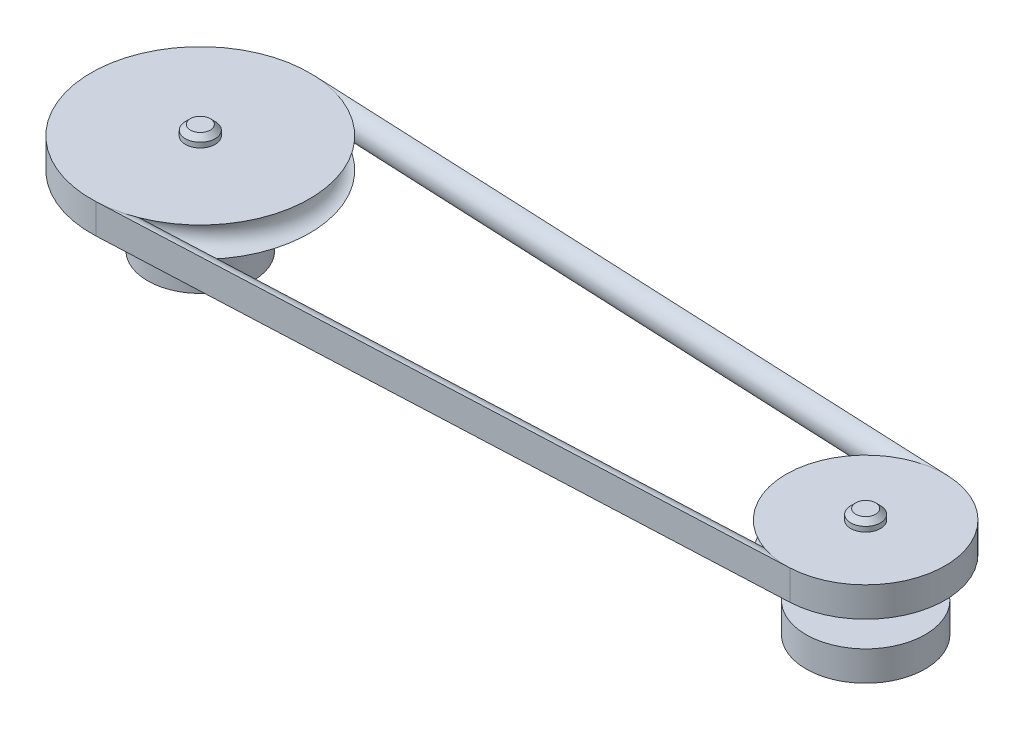
ISO-10303-21;
HEADER;
FILE_DESCRIPTION(('STEP AP214'),'2;1');
FILE_NAME('part.step','',(''),(''),'','','');
FILE_SCHEMA(('AUTOMOTIVE_DESIGN { 1 0 10303 214 1 1 1 1 }'));
ENDSEC;
DATA;
#1=APPLICATION_CONTEXT('core data for automotive mechanical design processes');
#2=APPLICATION_PROTOCOL_DEFINITION('international standard','automotive_design',2000,#1);
#3=PRODUCT_CONTEXT('',#1,'mechanical');
#4=PRODUCT('Part','Part','',(#3));
#5=PRODUCT_RELATED_PRODUCT_CATEGORY('part','',(#4));
#6=PRODUCT_DEFINITION_FORMATION('','',#4);
#7=PRODUCT_DEFINITION_CONTEXT('part definition',#1,'design');
#8=PRODUCT_DEFINITION('design','',#6,#7);
#9=PRODUCT_DEFINITION_SHAPE('','',#8);
#10=(LENGTH_UNIT() NAMED_UNIT(*) SI_UNIT(.MILLI.,.METRE.));
#11=(NAMED_UNIT(*) PLANE_ANGLE_UNIT() SI_UNIT($,.RADIAN.));
#12=(NAMED_UNIT(*) SI_UNIT($,.STERADIAN.) SOLID_ANGLE_UNIT());
#13=UNCERTAINTY_MEASURE_WITH_UNIT(LENGTH_MEASURE(1.E-05),#10,'distance_accuracy_value','');
#14=(GEOMETRIC_REPRESENTATION_CONTEXT(3) GLOBAL_UNCERTAINTY_ASSIGNED_CONTEXT((#13)) GLOBAL_UNIT_ASSIGNED_CONTEXT((#10,
#11,#12)) REPRESENTATION_CONTEXT('',''));
#15=CARTESIAN_POINT('',(0.,0.,0.));
#16=DIRECTION('',(0.,0.,1.));
#17=DIRECTION('',(1.,0.,0.));
#18=AXIS2_PLACEMENT_3D('',#15,#16,#17);
#19=CARTESIAN_POINT('',(-167.5,55.,0.));
#20=DIRECTION('',(0.,-1.,0.));
#21=DIRECTION('',(0.,0.,-1.));
#22=AXIS2_PLACEMENT_3D('',#19,#20,#21);
#23=CYLINDRICAL_SURFACE('',#22,7.50000000000001);
#24=CARTESIAN_POINT('',(-167.5,35.,0.));
#25=DIRECTION('',(0.,-1.,0.));
#26=DIRECTION('',(0.,0.,-1.));
#27=AXIS2_PLACEMENT_3D('',#24,#25,#26);
#28=CIRCLE('',#27,7.50000000000001);
#29=CARTESIAN_POINT('',(-167.5,35.,-7.50000000000001));
#30=VERTEX_POINT('',#29);
#31=EDGE_CURVE('E265',#30,#30,#28,.T.);
#32=ORIENTED_EDGE('',*,*,#31,.T.);
#33=EDGE_LOOP('',(#32));
#34=FACE_BOUND('',#33,.T.);
#35=CARTESIAN_POINT('',(-167.5,15.,0.));
#36=DIRECTION('',(0.,-1.,0.));
#37=DIRECTION('',(0.,0.,-1.));
#38=AXIS2_PLACEMENT_3D('',#35,#36,#37);
#39=CIRCLE('',#38,7.50000000000001);
#40=CARTESIAN_POINT('',(-167.5,15.,-7.50000000000001));
#41=VERTEX_POINT('',#40);
#42=EDGE_CURVE('E55',#41,#41,#39,.T.);
#43=ORIENTED_EDGE('',*,*,#42,.F.);
#44=EDGE_LOOP('',(#43));
#45=FACE_BOUND('',#44,.T.);
#46=ADVANCED_FACE('F46',(#34,#45),#23,.T.);
#47=CARTESIAN_POINT('',(-222.5,35.,0.));
#48=DIRECTION('',(0.,-1.,0.));
#49=DIRECTION('',(0.,0.,-1.));
#50=AXIS2_PLACEMENT_3D('',#47,#48,#49);
#51=PLANE('',#50);
#52=ORIENTED_EDGE('',*,*,#31,.F.);
#53=EDGE_LOOP('',(#52));
#54=FACE_BOUND('',#53,.T.);
#55=CARTESIAN_POINT('',(-167.5,35.,0.));
#56=DIRECTION('',(0.,-1.,0.));
#57=DIRECTION('',(0.,0.,-1.));
#58=AXIS2_PLACEMENT_3D('',#55,#56,#57);
#59=CIRCLE('',#58,55.);
#60=CARTESIAN_POINT('',(-165.037313432837,35.,54.9448375634319));
#61=VERTEX_POINT('',#60);
#62=CARTESIAN_POINT('',(-165.037313432835,35.,-54.9448375634318));
#63=VERTEX_POINT('',#62);
#64=EDGE_CURVE('E263',#61,#63,#59,.F.);
#65=ORIENTED_EDGE('',*,*,#64,.F.);
#66=CARTESIAN_POINT('',(-167.5,35.,0.));
#67=DIRECTION('',(0.,1.,0.));
#68=DIRECTION('',(0.,0.,1.));
#69=AXIS2_PLACEMENT_3D('',#66,#67,#68);
#70=CIRCLE('',#69,55.);
#71=EDGE_CURVE('E77',#63,#61,#70,.T.);
#72=ORIENTED_EDGE('',*,*,#71,.F.);
#73=EDGE_LOOP('',(#65,#72));
#74=FACE_BOUND('',#73,.T.);
#75=ADVANCED_FACE('F208',(#54,#74),#51,.T.);
#76=CARTESIAN_POINT('',(-167.5,42.5,0.));
#77=DIRECTION('',(0.,-1.,0.));
#78=DIRECTION('',(0.,0.,-1.));
#79=AXIS2_PLACEMENT_3D('',#76,#77,#78);
#80=TOROIDAL_SURFACE('',#79,55.,7.50000000000001);
#81=CARTESIAN_POINT('',(-165.037313432836,42.5,54.9448375634319));
#82=DIRECTION('',(0.998997046607851,0.,-0.0447761194029851));
#83=DIRECTION('',(0.,-1.,0.));
#84=AXIS2_PLACEMENT_3D('',#81,#82,#83);
#85=CIRCLE('',#84,7.50000000000001);
#86=CARTESIAN_POINT('',(-165.037313432836,50.,54.9448375634318));
#87=VERTEX_POINT('',#86);
#88=EDGE_CURVE('E116',#61,#87,#85,.T.);
#89=ORIENTED_EDGE('',*,*,#88,.F.);
#90=ORIENTED_EDGE('',*,*,#64,.T.);
#91=CARTESIAN_POINT('',(-165.037313432835,42.5,-54.9448375634318));
#92=DIRECTION('',(-0.998997046607851,0.,-0.0447761194029987));
#93=DIRECTION('',(0.0447761194029987,0.,-0.998997046607851));
#94=AXIS2_PLACEMENT_3D('',#91,#92,#93);
#95=CIRCLE('',#94,7.50000000000001);
#96=CARTESIAN_POINT('',(-165.037313432835,50.,-54.9448375634318));
#97=VERTEX_POINT('',#96);
#98=EDGE_CURVE('E240',#63,#97,#95,.T.);
#99=ORIENTED_EDGE('',*,*,#98,.T.);
#100=CARTESIAN_POINT('',(-167.5,50.,0.));
#101=DIRECTION('',(0.,-1.,0.));
#102=DIRECTION('',(0.,0.,-1.));
#103=AXIS2_PLACEMENT_3D('',#100,#101,#102);
#104=CIRCLE('',#103,55.);
#105=EDGE_CURVE('E176',#87,#97,#104,.F.);
#106=ORIENTED_EDGE('',*,*,#105,.F.);
#107=EDGE_LOOP('',(#89,#90,#99,#106));
#108=FACE_BOUND('',#107,.T.);
#109=ADVANCED_FACE('F157',(#108),#80,.F.);
#110=CARTESIAN_POINT('',(-167.5,55.,0.));
#111=DIRECTION('',(0.,1.,0.));
#112=DIRECTION('',(0.,0.,1.));
#113=AXIS2_PLACEMENT_3D('',#110,#111,#112);
#114=PLANE('',#113);
#115=CARTESIAN_POINT('',(-167.5,55.,0.));
#116=DIRECTION('',(0.,1.,0.));
#117=DIRECTION('',(0.,0.,1.));
#118=AXIS2_PLACEMENT_3D('',#115,#116,#117);
#119=CIRCLE('',#118,4.99999999999995);
#120=CARTESIAN_POINT('',(-167.5,55.,4.99999999999995));
#121=VERTEX_POINT('',#120);
#122=EDGE_CURVE('E238',#121,#121,#119,.T.);
#123=ORIENTED_EDGE('',*,*,#122,.T.);
#124=EDGE_LOOP('',(#123));
#125=FACE_BOUND('',#124,.T.);
#126=ADVANCED_FACE('F222',(#125),#114,.T.);
#127=CARTESIAN_POINT('',(-167.5,52.4999999999999,0.));
#128=DIRECTION('',(0.,1.,0.));
#129=DIRECTION('',(0.,0.,1.));
#130=AXIS2_PLACEMENT_3D('',#127,#128,#129);
#131=CIRCLE('',#130,7.50000000000001);
#132=CARTESIAN_POINT('',(-167.5,52.4999999999999,7.50000000000001));
#133=VERTEX_POINT('',#132);
#134=EDGE_CURVE('E233',#133,#133,#131,.F.);
#135=ORIENTED_EDGE('',*,*,#134,.T.);
#136=EDGE_LOOP('',(#135));
#137=FACE_BOUND('',#136,.T.);
#138=CARTESIAN_POINT('',(-167.5,50.,0.));
#139=DIRECTION('',(0.,1.,0.));
#140=DIRECTION('',(0.,0.,1.));
#141=AXIS2_PLACEMENT_3D('',#138,#139,#140);
#142=CIRCLE('',#141,7.50000000000001);
#143=CARTESIAN_POINT('',(-167.5,50.,7.50000000000001));
#144=VERTEX_POINT('',#143);
#145=EDGE_CURVE('E185',#144,#144,#142,.T.);
#146=ORIENTED_EDGE('',*,*,#145,.T.);
#147=EDGE_LOOP('',(#146));
#148=FACE_BOUND('',#147,.T.);
#149=ADVANCED_FACE('F211',(#137,#148),#23,.T.);
#150=CARTESIAN_POINT('',(-222.5,50.,0.));
#151=DIRECTION('',(0.,1.,0.));
#152=DIRECTION('',(0.,0.,1.));
#153=AXIS2_PLACEMENT_3D('',#150,#151,#152);
#154=PLANE('',#153);
#155=ORIENTED_EDGE('',*,*,#145,.F.);
#156=EDGE_LOOP('',(#155));
#157=FACE_BOUND('',#156,.T.);
#158=ORIENTED_EDGE('',*,*,#105,.T.);
#159=CARTESIAN_POINT('',(-167.5,50.,0.));
#160=DIRECTION('',(0.,1.,0.));
#161=DIRECTION('',(0.,0.,1.));
#162=AXIS2_PLACEMENT_3D('',#159,#160,#161);
#163=CIRCLE('',#162,55.);
#164=EDGE_CURVE('E121',#97,#87,#163,.T.);
#165=ORIENTED_EDGE('',*,*,#164,.T.);
#166=EDGE_LOOP('',(#158,#165));
#167=FACE_BOUND('',#166,.T.);
#168=ADVANCED_FACE('F156',(#157,#167),#154,.T.);
#169=CARTESIAN_POINT('',(169.291044776119,50.,39.9598818643141));
#170=DIRECTION('',(-0.0447761194029851,0.,-0.998997046607851));
#171=DIRECTION('',(-0.998997046607851,0.,0.0447761194029851));
#172=AXIS2_PLACEMENT_3D('',#169,#170,#171);
#173=PLANE('',#172);
#174=DIRECTION('',(0.,-1.,0.));
#175=VECTOR('',#174,1.);
#176=CARTESIAN_POINT('',(169.291044776119,50.,39.9598818643141));
#177=LINE('',#176,#175);
#178=CARTESIAN_POINT('',(169.291044776119,50.,39.9598818643141));
#179=VERTEX_POINT('',#178);
#180=CARTESIAN_POINT('',(169.291044776119,35.,39.9598818643141));
#181=VERTEX_POINT('',#180);
#182=EDGE_CURVE('E124',#179,#181,#177,.T.);
#183=ORIENTED_EDGE('',*,*,#182,.F.);
#184=DIRECTION('',(-0.998997046607851,0.,0.0447761194029851));
#185=VECTOR('',#184,1.);
#186=CARTESIAN_POINT('',(169.291044776119,50.,39.9598818643141));
#187=LINE('',#186,#185);
#188=EDGE_CURVE('E112',#179,#87,#187,.T.);
#189=ORIENTED_EDGE('',*,*,#188,.T.);
#190=CARTESIAN_POINT('',(-165.037313432837,50.,54.9448375634319));
#191=DIRECTION('',(0.,-1.,0.));
#192=VECTOR('',#191,1.);
#193=LINE('',#190,#192);
#194=EDGE_CURVE('E120',#87,#61,#193,.T.);
#195=ORIENTED_EDGE('',*,*,#194,.T.);
#196=DIRECTION('',(-0.998997046607851,0.,0.0447761194029851));
#197=VECTOR('',#196,1.);
#198=CARTESIAN_POINT('',(169.291044776119,35.,39.9598818643141));
#199=LINE('',#198,#197);
#200=EDGE_CURVE('E126',#181,#61,#199,.T.);
#201=ORIENTED_EDGE('',*,*,#200,.F.);
#202=EDGE_LOOP('',(#183,#189,#195,#201));
#203=FACE_BOUND('',#202,.T.);
#204=ADVANCED_FACE('F125',(#203),#173,.F.);
#205=CARTESIAN_POINT('',(169.291044776119,42.5,39.9598818643141));
#206=DIRECTION('',(-0.998997046607851,0.,0.0447761194029851));
#207=DIRECTION('',(0.0447761194029851,0.,0.998997046607851));
#208=AXIS2_PLACEMENT_3D('',#205,#206,#207);
#209=CYLINDRICAL_SURFACE('',#208,7.50000000000001);
#210=CARTESIAN_POINT('',(169.291044776119,42.5,39.9598818643141));
#211=DIRECTION('',(0.998997046607852,0.,-0.0447761194029716));
#212=DIRECTION('',(0.0447761194029716,0.,0.998997046607852));
#213=AXIS2_PLACEMENT_3D('',#210,#211,#212);
#214=CIRCLE('',#213,7.50000000000001);
#215=EDGE_CURVE('E94',#181,#179,#214,.T.);
#216=ORIENTED_EDGE('',*,*,#215,.F.);
#217=ORIENTED_EDGE('',*,*,#200,.T.);
#218=ORIENTED_EDGE('',*,*,#88,.T.);
#219=ORIENTED_EDGE('',*,*,#188,.F.);
#220=EDGE_LOOP('',(#216,#217,#218,#219));
#221=FACE_BOUND('',#220,.T.);
#222=ADVANCED_FACE('F114',(#221),#209,.T.);
#223=CARTESIAN_POINT('',(167.5,42.5,0.));
#224=DIRECTION('',(0.,-1.,0.));
#225=DIRECTION('',(0.,0.,-1.));
#226=AXIS2_PLACEMENT_3D('',#223,#224,#225);
#227=CYLINDRICAL_SURFACE('',#226,40.);
#228=DIRECTION('',(0.,-1.,0.));
#229=VECTOR('',#228,1.);
#230=CARTESIAN_POINT('',(169.29104477612,50.,-39.9598818643141));
#231=LINE('',#230,#229);
#232=CARTESIAN_POINT('',(169.29104477612,50.,-39.9598818643141));
#233=VERTEX_POINT('',#232);
#234=CARTESIAN_POINT('',(169.291044776119,35.,-39.9598818643141));
#235=VERTEX_POINT('',#234);
#236=EDGE_CURVE('E132',#233,#235,#231,.T.);
#237=ORIENTED_EDGE('',*,*,#236,.F.);
#238=CARTESIAN_POINT('',(167.5,50.,0.));
#239=DIRECTION('',(0.,-1.,0.));
#240=DIRECTION('',(0.,0.,-1.));
#241=AXIS2_PLACEMENT_3D('',#238,#239,#240);
#242=CIRCLE('',#241,40.);
#243=EDGE_CURVE('E62',#233,#179,#242,.T.);
#244=ORIENTED_EDGE('',*,*,#243,.T.);
#245=ORIENTED_EDGE('',*,*,#182,.T.);
#246=CARTESIAN_POINT('',(167.5,35.,0.));
#247=DIRECTION('',(0.,-1.,0.));
#248=DIRECTION('',(0.,0.,-1.));
#249=AXIS2_PLACEMENT_3D('',#246,#247,#248);
#250=CIRCLE('',#249,40.);
#251=EDGE_CURVE('E135',#235,#181,#250,.T.);
#252=ORIENTED_EDGE('',*,*,#251,.F.);
#253=EDGE_LOOP('',(#237,#244,#245,#252));
#254=FACE_BOUND('',#253,.T.);
#255=ADVANCED_FACE('F130',(#254),#227,.T.);
#256=CARTESIAN_POINT('',(-165.037313432835,50.,-54.9448375634318));
#257=DIRECTION('',(-0.044776119402985,0.,0.998997046607851));
#258=DIRECTION('',(0.998997046607851,0.,0.044776119402985));
#259=AXIS2_PLACEMENT_3D('',#256,#257,#258);
#260=PLANE('',#259);
#261=DIRECTION('',(0.,-1.,0.));
#262=VECTOR('',#261,1.);
#263=CARTESIAN_POINT('',(-165.037313432835,50.,-54.9448375634318));
#264=LINE('',#263,#262);
#265=EDGE_CURVE('E172',#97,#63,#264,.T.);
#266=ORIENTED_EDGE('',*,*,#265,.F.);
#267=DIRECTION('',(0.998997046607851,0.,0.044776119402985));
#268=VECTOR('',#267,1.);
#269=CARTESIAN_POINT('',(-165.037313432835,50.,-54.9448375634318));
#270=LINE('',#269,#268);
#271=EDGE_CURVE('E85',#97,#233,#270,.T.);
#272=ORIENTED_EDGE('',*,*,#271,.T.);
#273=ORIENTED_EDGE('',*,*,#236,.T.);
#274=DIRECTION('',(0.998997046607851,0.,0.044776119402985));
#275=VECTOR('',#274,1.);
#276=CARTESIAN_POINT('',(-165.037313432835,35.,-54.9448375634318));
#277=LINE('',#276,#275);
#278=EDGE_CURVE('E275',#63,#235,#277,.T.);
#279=ORIENTED_EDGE('',*,*,#278,.F.);
#280=EDGE_LOOP('',(#266,#272,#273,#279));
#281=FACE_BOUND('',#280,.T.);
#282=ADVANCED_FACE('F201',(#281),#260,.F.);
#283=CARTESIAN_POINT('',(-165.037313432835,42.5,-54.9448375634318));
#284=DIRECTION('',(0.998997046607851,0.,0.044776119402985));
#285=DIRECTION('',(0.044776119402985,0.,-0.998997046607851));
#286=AXIS2_PLACEMENT_3D('',#283,#284,#285);
#287=CYLINDRICAL_SURFACE('',#286,7.50000000000001);
#288=ORIENTED_EDGE('',*,*,#98,.F.);
#289=ORIENTED_EDGE('',*,*,#278,.T.);
#290=CARTESIAN_POINT('',(169.29104477612,42.5,-39.9598818643141));
#291=DIRECTION('',(-0.998997046607851,0.,-0.0447761194029987));
#292=DIRECTION('',(0.0447761194029987,0.,-0.998997046607851));
#293=AXIS2_PLACEMENT_3D('',#290,#291,#292);
#294=CIRCLE('',#293,7.50000000000001);
#295=EDGE_CURVE('E273',#235,#233,#294,.T.);
#296=ORIENTED_EDGE('',*,*,#295,.T.);
#297=ORIENTED_EDGE('',*,*,#271,.F.);
#298=EDGE_LOOP('',(#288,#289,#296,#297));
#299=FACE_BOUND('',#298,.T.);
#300=ADVANCED_FACE('F198',(#299),#287,.T.);
#301=CARTESIAN_POINT('',(-167.5,42.5,0.));
#302=DIRECTION('',(0.,1.,0.));
#303=DIRECTION('',(0.,0.,1.));
#304=AXIS2_PLACEMENT_3D('',#301,#302,#303);
#305=CYLINDRICAL_SURFACE('',#304,55.);
#306=ORIENTED_EDGE('',*,*,#265,.T.);
#307=ORIENTED_EDGE('',*,*,#71,.T.);
#308=ORIENTED_EDGE('',*,*,#194,.F.);
#309=ORIENTED_EDGE('',*,*,#164,.F.);
#310=EDGE_LOOP('',(#306,#307,#308,#309));
#311=FACE_BOUND('',#310,.T.);
#312=ADVANCED_FACE('F187',(#311),#305,.T.);
#313=CARTESIAN_POINT('',(167.5,55.,0.));
#314=DIRECTION('',(0.,-1.,0.));
#315=DIRECTION('',(0.,0.,-1.));
#316=AXIS2_PLACEMENT_3D('',#313,#314,#315);
#317=CYLINDRICAL_SURFACE('',#316,7.50000000000001);
#318=CARTESIAN_POINT('',(167.5,15.,0.));
#319=DIRECTION('',(0.,-1.,0.));
#320=DIRECTION('',(0.,0.,-1.));
#321=AXIS2_PLACEMENT_3D('',#318,#319,#320);
#322=CIRCLE('',#321,7.50000000000001);
#323=CARTESIAN_POINT('',(167.5,15.,-7.50000000000001));
#324=VERTEX_POINT('',#323);
#325=EDGE_CURVE('E12',#324,#324,#322,.T.);
#326=ORIENTED_EDGE('',*,*,#325,.F.);
#327=EDGE_LOOP('',(#326));
#328=FACE_BOUND('',#327,.T.);
#329=CARTESIAN_POINT('',(167.5,35.,0.));
#330=DIRECTION('',(0.,1.,0.));
#331=DIRECTION('',(0.,0.,1.));
#332=AXIS2_PLACEMENT_3D('',#329,#330,#331);
#333=CIRCLE('',#332,7.50000000000001);
#334=CARTESIAN_POINT('',(167.5,35.,7.50000000000001));
#335=VERTEX_POINT('',#334);
#336=EDGE_CURVE('E136',#335,#335,#333,.T.);
#337=ORIENTED_EDGE('',*,*,#336,.F.);
#338=EDGE_LOOP('',(#337));
#339=FACE_BOUND('',#338,.T.);
#340=ADVANCED_FACE('F197',(#328,#339),#317,.T.);
#341=CARTESIAN_POINT('',(167.5,35.,0.));
#342=DIRECTION('',(0.,1.,0.));
#343=DIRECTION('',(0.,0.,1.));
#344=AXIS2_PLACEMENT_3D('',#341,#342,#343);
#345=PLANE('',#344);
#346=ORIENTED_EDGE('',*,*,#336,.T.);
#347=EDGE_LOOP('',(#346));
#348=FACE_BOUND('',#347,.T.);
#349=ORIENTED_EDGE('',*,*,#251,.T.);
#350=CARTESIAN_POINT('',(167.5,35.,0.));
#351=DIRECTION('',(0.,1.,0.));
#352=DIRECTION('',(0.,0.,1.));
#353=AXIS2_PLACEMENT_3D('',#350,#351,#352);
#354=CIRCLE('',#353,40.);
#355=EDGE_CURVE('E99',#181,#235,#354,.F.);
#356=ORIENTED_EDGE('',*,*,#355,.T.);
#357=EDGE_LOOP('',(#349,#356));
#358=FACE_BOUND('',#357,.T.);
#359=ADVANCED_FACE('F282',(#348,#358),#345,.F.);
#360=CARTESIAN_POINT('',(167.5,42.5,0.));
#361=DIRECTION('',(0.,1.,0.));
#362=DIRECTION('',(0.,0.,1.));
#363=AXIS2_PLACEMENT_3D('',#360,#361,#362);
#364=TOROIDAL_SURFACE('',#363,40.,7.50000000000001);
#365=ORIENTED_EDGE('',*,*,#215,.T.);
#366=CARTESIAN_POINT('',(167.5,50.,0.));
#367=DIRECTION('',(0.,1.,0.));
#368=DIRECTION('',(0.,0.,1.));
#369=AXIS2_PLACEMENT_3D('',#366,#367,#368);
#370=CIRCLE('',#369,40.);
#371=EDGE_CURVE('E96',#233,#179,#370,.T.);
#372=ORIENTED_EDGE('',*,*,#371,.F.);
#373=ORIENTED_EDGE('',*,*,#295,.F.);
#374=ORIENTED_EDGE('',*,*,#355,.F.);
#375=EDGE_LOOP('',(#365,#372,#373,#374));
#376=FACE_BOUND('',#375,.T.);
#377=ADVANCED_FACE('F95',(#376),#364,.F.);
#378=CARTESIAN_POINT('',(167.5,55.,0.));
#379=DIRECTION('',(0.,1.,0.));
#380=DIRECTION('',(0.,0.,1.));
#381=AXIS2_PLACEMENT_3D('',#378,#379,#380);
#382=PLANE('',#381);
#383=CARTESIAN_POINT('',(167.5,55.,0.));
#384=DIRECTION('',(0.,1.,0.));
#385=DIRECTION('',(0.,0.,1.));
#386=AXIS2_PLACEMENT_3D('',#383,#384,#385);
#387=CIRCLE('',#386,4.99999999999995);
#388=CARTESIAN_POINT('',(167.5,55.,4.99999999999995));
#389=VERTEX_POINT('',#388);
#390=EDGE_CURVE('E105',#389,#389,#387,.T.);
#391=ORIENTED_EDGE('',*,*,#390,.T.);
#392=EDGE_LOOP('',(#391));
#393=FACE_BOUND('',#392,.T.);
#394=ADVANCED_FACE('F300',(#393),#382,.T.);
#395=CARTESIAN_POINT('',(167.5,52.4999999999999,0.));
#396=DIRECTION('',(0.,1.,0.));
#397=DIRECTION('',(0.,0.,1.));
#398=AXIS2_PLACEMENT_3D('',#395,#396,#397);
#399=CIRCLE('',#398,7.50000000000001);
#400=CARTESIAN_POINT('',(167.5,52.4999999999999,7.50000000000001));
#401=VERTEX_POINT('',#400);
#402=EDGE_CURVE('E243',#401,#401,#399,.F.);
#403=ORIENTED_EDGE('',*,*,#402,.T.);
#404=EDGE_LOOP('',(#403));
#405=FACE_BOUND('',#404,.T.);
#406=CARTESIAN_POINT('',(167.5,50.,0.));
#407=DIRECTION('',(0.,-1.,0.));
#408=DIRECTION('',(0.,0.,-1.));
#409=AXIS2_PLACEMENT_3D('',#406,#407,#408);
#410=CIRCLE('',#409,7.50000000000001);
#411=CARTESIAN_POINT('',(167.5,50.,-7.50000000000001));
#412=VERTEX_POINT('',#411);
#413=EDGE_CURVE('E108',#412,#412,#410,.T.);
#414=ORIENTED_EDGE('',*,*,#413,.F.);
#415=EDGE_LOOP('',(#414));
#416=FACE_BOUND('',#415,.T.);
#417=ADVANCED_FACE('F293',(#405,#416),#317,.T.);
#418=CARTESIAN_POINT('',(167.5,50.,0.));
#419=DIRECTION('',(0.,-1.,0.));
#420=DIRECTION('',(0.,0.,-1.));
#421=AXIS2_PLACEMENT_3D('',#418,#419,#420);
#422=PLANE('',#421);
#423=ORIENTED_EDGE('',*,*,#413,.T.);
#424=EDGE_LOOP('',(#423));
#425=FACE_BOUND('',#424,.T.);
#426=ORIENTED_EDGE('',*,*,#243,.F.);
#427=ORIENTED_EDGE('',*,*,#371,.T.);
#428=EDGE_LOOP('',(#426,#427));
#429=FACE_BOUND('',#428,.T.);
#430=ADVANCED_FACE('F107',(#425,#429),#422,.F.);
#431=CARTESIAN_POINT('',(167.5,55.,0.));
#432=DIRECTION('',(0.,-1.,0.));
#433=DIRECTION('',(0.,0.,-1.));
#434=AXIS2_PLACEMENT_3D('',#431,#432,#433);
#435=CONICAL_SURFACE('',#434,4.99999999999995,0.785398163397443);
#436=ORIENTED_EDGE('',*,*,#402,.F.);
#437=EDGE_LOOP('',(#436));
#438=FACE_BOUND('',#437,.T.);
#439=ORIENTED_EDGE('',*,*,#390,.F.);
#440=EDGE_LOOP('',(#439));
#441=FACE_BOUND('',#440,.T.);
#442=ADVANCED_FACE('F306',(#438,#441),#435,.T.);
#443=CARTESIAN_POINT('',(-167.5,55.,0.));
#444=DIRECTION('',(0.,-1.,0.));
#445=DIRECTION('',(0.,0.,-1.));
#446=AXIS2_PLACEMENT_3D('',#443,#444,#445);
#447=CONICAL_SURFACE('',#446,4.99999999999995,0.785398163397443);
#448=ORIENTED_EDGE('',*,*,#134,.F.);
#449=EDGE_LOOP('',(#448));
#450=FACE_BOUND('',#449,.T.);
#451=ORIENTED_EDGE('',*,*,#122,.F.);
#452=EDGE_LOOP('',(#451));
#453=FACE_BOUND('',#452,.T.);
#454=ADVANCED_FACE('F316',(#450,#453),#447,.T.);
#455=CARTESIAN_POINT('',(-167.5,15.,0.));
#456=DIRECTION('',(0.,-1.,0.));
#457=DIRECTION('',(0.,0.,-1.));
#458=AXIS2_PLACEMENT_3D('',#455,#456,#457);
#459=PLANE('',#458);
#460=ORIENTED_EDGE('',*,*,#42,.T.);
#461=EDGE_LOOP('',(#460));
#462=FACE_BOUND('',#461,.T.);
#463=ADVANCED_FACE('F321',(#462),#459,.T.);
#464=CARTESIAN_POINT('',(167.5,15.,0.));
#465=DIRECTION('',(0.,-1.,0.));
#466=DIRECTION('',(0.,0.,-1.));
#467=AXIS2_PLACEMENT_3D('',#464,#465,#466);
#468=PLANE('',#467);
#469=ORIENTED_EDGE('',*,*,#325,.T.);
#470=EDGE_LOOP('',(#469));
#471=FACE_BOUND('',#470,.T.);
#472=ADVANCED_FACE('F48',(#471),#468,.T.);
#473=CLOSED_SHELL('',(#46,#75,#109,#126,#149,#168,#204,#222,#255,#282,#300,#312,#340,#359,#377,
#394,#417,#430,#442,#454,#463,#472));
#474=MANIFOLD_SOLID_BREP('B2',#473);
#475=CARTESIAN_POINT('',(0.,15.,0.));
#476=DIRECTION('',(0.,1.,0.));
#477=DIRECTION('',(0.,0.,1.));
#478=AXIS2_PLACEMENT_3D('',#475,#476,#477);
#479=PLANE('',#478);
#480=CARTESIAN_POINT('',(167.5,15.,0.));
#481=DIRECTION('',(0.,-1.,0.));
#482=DIRECTION('',(0.,0.,-1.));
#483=AXIS2_PLACEMENT_3D('',#480,#481,#482);
#484=CIRCLE('',#483,7.50000000000001);
#485=CARTESIAN_POINT('',(167.5,15.,-7.50000000000001));
#486=VERTEX_POINT('',#485);
#487=EDGE_CURVE('E45',#486,#486,#484,.T.);
#488=ORIENTED_EDGE('',*,*,#487,.T.);
#489=EDGE_LOOP('',(#488));
#490=FACE_BOUND('',#489,.T.);
#491=CARTESIAN_POINT('',(167.5,15.,0.));
#492=DIRECTION('',(0.,1.,0.));
#493=DIRECTION('',(0.,0.,1.));
#494=AXIS2_PLACEMENT_3D('',#491,#492,#493);
#495=CIRCLE('',#494,30.);
#496=CARTESIAN_POINT('',(167.5,15.,30.));
#497=VERTEX_POINT('',#496);
#498=EDGE_CURVE('E472',#497,#497,#495,.T.);
#499=ORIENTED_EDGE('',*,*,#498,.T.);
#500=EDGE_LOOP('',(#499));
#501=FACE_BOUND('',#500,.T.);
#502=ADVANCED_FACE('F469',(#490,#501),#479,.T.);
#503=CARTESIAN_POINT('',(167.5,15.,0.));
#504=DIRECTION('',(0.,-1.,0.));
#505=DIRECTION('',(0.,0.,-1.));
#506=AXIS2_PLACEMENT_3D('',#503,#504,#505);
#507=CYLINDRICAL_SURFACE('',#506,30.);
#508=ORIENTED_EDGE('',*,*,#498,.F.);
#509=EDGE_LOOP('',(#508));
#510=FACE_BOUND('',#509,.T.);
#511=CARTESIAN_POINT('',(167.5,0.,0.));
#512=DIRECTION('',(0.,1.,0.));
#513=DIRECTION('',(0.,0.,1.));
#514=AXIS2_PLACEMENT_3D('',#511,#512,#513);
#515=CIRCLE('',#514,30.);
#516=CARTESIAN_POINT('',(167.5,0.,30.));
#517=VERTEX_POINT('',#516);
#518=EDGE_CURVE('E480',#517,#517,#515,.T.);
#519=ORIENTED_EDGE('',*,*,#518,.T.);
#520=EDGE_LOOP('',(#519));
#521=FACE_BOUND('',#520,.T.);
#522=ADVANCED_FACE('F487',(#510,#521),#507,.T.);
#523=CARTESIAN_POINT('',(0.,0.,0.));
#524=DIRECTION('',(0.,1.,0.));
#525=DIRECTION('',(0.,0.,1.));
#526=AXIS2_PLACEMENT_3D('',#523,#524,#525);
#527=PLANE('',#526);
#528=CARTESIAN_POINT('',(167.5,0.,0.));
#529=DIRECTION('',(0.,-1.,0.));
#530=DIRECTION('',(0.,0.,-1.));
#531=AXIS2_PLACEMENT_3D('',#528,#529,#530);
#532=CIRCLE('',#531,7.50000000000001);
#533=CARTESIAN_POINT('',(167.5,0.,-7.50000000000001));
#534=VERTEX_POINT('',#533);
#535=EDGE_CURVE('E482',#534,#534,#532,.T.);
#536=ORIENTED_EDGE('',*,*,#535,.F.);
#537=EDGE_LOOP('',(#536));
#538=FACE_BOUND('',#537,.T.);
#539=ORIENTED_EDGE('',*,*,#518,.F.);
#540=EDGE_LOOP('',(#539));
#541=FACE_BOUND('',#540,.T.);
#542=ADVANCED_FACE('F489',(#538,#541),#527,.F.);
#543=CARTESIAN_POINT('',(167.5,15.,0.));
#544=DIRECTION('',(0.,-1.,0.));
#545=DIRECTION('',(0.,0.,-1.));
#546=AXIS2_PLACEMENT_3D('',#543,#544,#545);
#547=CYLINDRICAL_SURFACE('',#546,7.50000000000001);
#548=ORIENTED_EDGE('',*,*,#487,.F.);
#549=EDGE_LOOP('',(#548));
#550=FACE_BOUND('',#549,.T.);
#551=ORIENTED_EDGE('',*,*,#535,.T.);
#552=EDGE_LOOP('',(#551));
#553=FACE_BOUND('',#552,.T.);
#554=ADVANCED_FACE('F491',(#550,#553),#547,.F.);
#555=CLOSED_SHELL('',(#502,#522,#542,#554));
#556=MANIFOLD_SOLID_BREP('B6',#555);
#557=CARTESIAN_POINT('',(0.,15.,0.));
#558=DIRECTION('',(0.,1.,0.));
#559=DIRECTION('',(0.,0.,1.));
#560=AXIS2_PLACEMENT_3D('',#557,#558,#559);
#561=PLANE('',#560);
#562=CARTESIAN_POINT('',(-167.5,15.,0.));
#563=DIRECTION('',(0.,-1.,0.));
#564=DIRECTION('',(0.,0.,-1.));
#565=AXIS2_PLACEMENT_3D('',#562,#563,#564);
#566=CIRCLE('',#565,7.50000000000001);
#567=CARTESIAN_POINT('',(-167.5,15.,-7.50000000000001));
#568=VERTEX_POINT('',#567);
#569=EDGE_CURVE('E468',#568,#568,#566,.T.);
#570=ORIENTED_EDGE('',*,*,#569,.T.);
#571=EDGE_LOOP('',(#570));
#572=FACE_BOUND('',#571,.T.);
#573=CARTESIAN_POINT('',(-167.5,15.,0.));
#574=DIRECTION('',(0.,1.,0.));
#575=DIRECTION('',(0.,0.,1.));
#576=AXIS2_PLACEMENT_3D('',#573,#574,#575);
#577=CIRCLE('',#576,26.5);
#578=CARTESIAN_POINT('',(-167.5,15.,26.5));
#579=VERTEX_POINT('',#578);
#580=EDGE_CURVE('E541',#579,#579,#577,.T.);
#581=ORIENTED_EDGE('',*,*,#580,.T.);
#582=EDGE_LOOP('',(#581));
#583=FACE_BOUND('',#582,.T.);
#584=ADVANCED_FACE('F533',(#572,#583),#561,.T.);
#585=CARTESIAN_POINT('',(-167.5,15.,0.));
#586=DIRECTION('',(0.,-1.,0.));
#587=DIRECTION('',(0.,0.,-1.));
#588=AXIS2_PLACEMENT_3D('',#585,#586,#587);
#589=CYLINDRICAL_SURFACE('',#588,26.5);
#590=ORIENTED_EDGE('',*,*,#580,.F.);
#591=EDGE_LOOP('',(#590));
#592=FACE_BOUND('',#591,.T.);
#593=CARTESIAN_POINT('',(-167.5,0.,0.));
#594=DIRECTION('',(0.,1.,0.));
#595=DIRECTION('',(0.,0.,1.));
#596=AXIS2_PLACEMENT_3D('',#593,#594,#595);
#597=CIRCLE('',#596,26.5);
#598=CARTESIAN_POINT('',(-167.5,0.,26.5));
#599=VERTEX_POINT('',#598);
#600=EDGE_CURVE('E537',#599,#599,#597,.T.);
#601=ORIENTED_EDGE('',*,*,#600,.T.);
#602=EDGE_LOOP('',(#601));
#603=FACE_BOUND('',#602,.T.);
#604=ADVANCED_FACE('F535',(#592,#603),#589,.T.);
#605=CARTESIAN_POINT('',(0.,0.,0.));
#606=DIRECTION('',(0.,1.,0.));
#607=DIRECTION('',(0.,0.,1.));
#608=AXIS2_PLACEMENT_3D('',#605,#606,#607);
#609=PLANE('',#608);
#610=CARTESIAN_POINT('',(-167.5,0.,0.));
#611=DIRECTION('',(0.,-1.,0.));
#612=DIRECTION('',(0.,0.,-1.));
#613=AXIS2_PLACEMENT_3D('',#610,#611,#612);
#614=CIRCLE('',#613,7.50000000000001);
#615=CARTESIAN_POINT('',(-167.5,0.,-7.50000000000001));
#616=VERTEX_POINT('',#615);
#617=EDGE_CURVE('E547',#616,#616,#614,.T.);
#618=ORIENTED_EDGE('',*,*,#617,.F.);
#619=EDGE_LOOP('',(#618));
#620=FACE_BOUND('',#619,.T.);
#621=ORIENTED_EDGE('',*,*,#600,.F.);
#622=EDGE_LOOP('',(#621));
#623=FACE_BOUND('',#622,.T.);
#624=ADVANCED_FACE('F555',(#620,#623),#609,.F.);
#625=CARTESIAN_POINT('',(-167.5,15.,0.));
#626=DIRECTION('',(0.,-1.,0.));
#627=DIRECTION('',(0.,0.,-1.));
#628=AXIS2_PLACEMENT_3D('',#625,#626,#627);
#629=CYLINDRICAL_SURFACE('',#628,7.50000000000001);
#630=ORIENTED_EDGE('',*,*,#569,.F.);
#631=EDGE_LOOP('',(#630));
#632=FACE_BOUND('',#631,.T.);
#633=ORIENTED_EDGE('',*,*,#617,.T.);
#634=EDGE_LOOP('',(#633));
#635=FACE_BOUND('',#634,.T.);
#636=ADVANCED_FACE('F557',(#632,#635),#629,.F.);
#637=CLOSED_SHELL('',(#584,#604,#624,#636));
#638=MANIFOLD_SOLID_BREP('B40',#637);
#639=ADVANCED_BREP_SHAPE_REPRESENTATION('',(#18,#474,#556,#638),#14);
#640=SHAPE_DEFINITION_REPRESENTATION(#9,#639);
ENDSEC;
END-ISO-10303-21;
